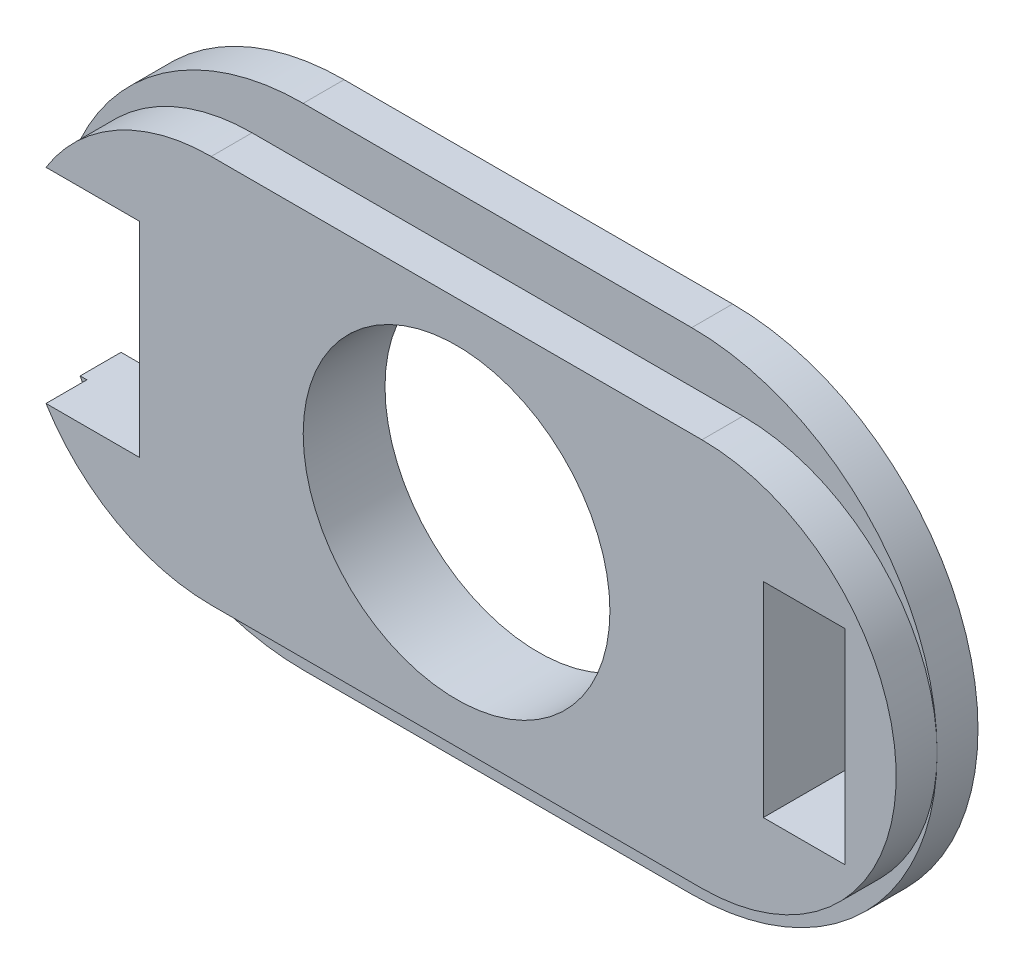
ISO-10303-21;
HEADER;
FILE_DESCRIPTION(('STEP AP214'),'2;1');
FILE_NAME('part.step','',(''),(''),'','','');
FILE_SCHEMA(('AUTOMOTIVE_DESIGN { 1 0 10303 214 1 1 1 1 }'));
ENDSEC;
DATA;
#1=APPLICATION_CONTEXT('core data for automotive mechanical design processes');
#2=APPLICATION_PROTOCOL_DEFINITION('international standard','automotive_design',2000,#1);
#3=PRODUCT_CONTEXT('',#1,'mechanical');
#4=PRODUCT('Part','Part','',(#3));
#5=PRODUCT_RELATED_PRODUCT_CATEGORY('part','',(#4));
#6=PRODUCT_DEFINITION_FORMATION('','',#4);
#7=PRODUCT_DEFINITION_CONTEXT('part definition',#1,'design');
#8=PRODUCT_DEFINITION('design','',#6,#7);
#9=PRODUCT_DEFINITION_SHAPE('','',#8);
#10=(LENGTH_UNIT() NAMED_UNIT(*) SI_UNIT(.MILLI.,.METRE.));
#11=(NAMED_UNIT(*) PLANE_ANGLE_UNIT() SI_UNIT($,.RADIAN.));
#12=(NAMED_UNIT(*) SI_UNIT($,.STERADIAN.) SOLID_ANGLE_UNIT());
#13=UNCERTAINTY_MEASURE_WITH_UNIT(LENGTH_MEASURE(1.E-05),#10,'distance_accuracy_value','');
#14=(GEOMETRIC_REPRESENTATION_CONTEXT(3) GLOBAL_UNCERTAINTY_ASSIGNED_CONTEXT((#13)) GLOBAL_UNIT_ASSIGNED_CONTEXT((#10,
#11,#12)) REPRESENTATION_CONTEXT('',''));
#15=CARTESIAN_POINT('',(0.,0.,0.));
#16=DIRECTION('',(0.,0.,1.));
#17=DIRECTION('',(1.,0.,0.));
#18=AXIS2_PLACEMENT_3D('',#15,#16,#17);
#19=CARTESIAN_POINT('',(-57.049073,21.907042,2.));
#20=DIRECTION('',(0.,0.,-1.));
#21=DIRECTION('',(-1.,0.,0.));
#22=AXIS2_PLACEMENT_3D('',#19,#20,#21);
#23=CYLINDRICAL_SURFACE('',#22,12.);
#24=CARTESIAN_POINT('',(-57.049073,21.907042,0.));
#25=DIRECTION('',(0.,0.,1.));
#26=DIRECTION('',(1.,0.,0.));
#27=AXIS2_PLACEMENT_3D('',#24,#25,#26);
#28=CIRCLE('',#27,12.);
#29=CARTESIAN_POINT('',(-57.049073,33.907042,0.));
#30=VERTEX_POINT('',#29);
#31=CARTESIAN_POINT('',(-67.9577851146357,26.907042,0.));
#32=VERTEX_POINT('',#31);
#33=EDGE_CURVE('E273',#30,#32,#28,.T.);
#34=ORIENTED_EDGE('',*,*,#33,.T.);
#35=DIRECTION('',(0.,0.,-1.));
#36=VECTOR('',#35,1.);
#37=CARTESIAN_POINT('',(-67.9577851146357,26.907042,2.));
#38=LINE('',#37,#36);
#39=CARTESIAN_POINT('',(-67.9577851146357,26.907042,2.));
#40=VERTEX_POINT('',#39);
#41=EDGE_CURVE('E199',#32,#40,#38,.F.);
#42=ORIENTED_EDGE('',*,*,#41,.T.);
#43=CARTESIAN_POINT('',(-57.049073,21.907042,2.));
#44=DIRECTION('',(0.,0.,1.));
#45=DIRECTION('',(1.,0.,0.));
#46=AXIS2_PLACEMENT_3D('',#43,#44,#45);
#47=CIRCLE('',#46,12.);
#48=CARTESIAN_POINT('',(-57.049073,33.907042,2.));
#49=VERTEX_POINT('',#48);
#50=EDGE_CURVE('E283',#49,#40,#47,.T.);
#51=ORIENTED_EDGE('',*,*,#50,.F.);
#52=DIRECTION('',(0.,0.,-1.));
#53=VECTOR('',#52,1.);
#54=CARTESIAN_POINT('',(-57.049073,33.907042,2.));
#55=LINE('',#54,#53);
#56=EDGE_CURVE('E294',#49,#30,#55,.T.);
#57=ORIENTED_EDGE('',*,*,#56,.T.);
#58=EDGE_LOOP('',(#34,#42,#51,#57));
#59=FACE_BOUND('',#58,.T.);
#60=ADVANCED_FACE('F33',(#59),#23,.T.);
#61=CARTESIAN_POINT('',(-59.549073,21.907042,4.));
#62=DIRECTION('',(0.,0.,-1.));
#63=DIRECTION('',(-1.,0.,0.));
#64=AXIS2_PLACEMENT_3D('',#61,#62,#63);
#65=CYLINDRICAL_SURFACE('',#64,9.5);
#66=CARTESIAN_POINT('',(-59.549073,21.907042,2.));
#67=DIRECTION('',(0.,0.,1.));
#68=DIRECTION('',(1.,0.,0.));
#69=AXIS2_PLACEMENT_3D('',#66,#67,#68);
#70=CIRCLE('',#69,9.5);
#71=CARTESIAN_POINT('',(-59.549073,31.407042,2.));
#72=VERTEX_POINT('',#71);
#73=CARTESIAN_POINT('',(-67.6268202107018,26.907042,2.));
#74=VERTEX_POINT('',#73);
#75=EDGE_CURVE('E238',#72,#74,#70,.T.);
#76=ORIENTED_EDGE('',*,*,#75,.T.);
#77=DIRECTION('',(0.,0.,-1.));
#78=VECTOR('',#77,1.);
#79=CARTESIAN_POINT('',(-67.6268202107018,26.907042,4.));
#80=LINE('',#79,#78);
#81=CARTESIAN_POINT('',(-67.6268202107018,26.907042,4.));
#82=VERTEX_POINT('',#81);
#83=EDGE_CURVE('E194',#74,#82,#80,.F.);
#84=ORIENTED_EDGE('',*,*,#83,.T.);
#85=CARTESIAN_POINT('',(-59.549073,21.907042,4.));
#86=DIRECTION('',(0.,0.,1.));
#87=DIRECTION('',(1.,0.,0.));
#88=AXIS2_PLACEMENT_3D('',#85,#86,#87);
#89=CIRCLE('',#88,9.5);
#90=CARTESIAN_POINT('',(-59.549073,31.407042,4.));
#91=VERTEX_POINT('',#90);
#92=EDGE_CURVE('E252',#91,#82,#89,.T.);
#93=ORIENTED_EDGE('',*,*,#92,.F.);
#94=DIRECTION('',(0.,0.,-1.));
#95=VECTOR('',#94,1.);
#96=CARTESIAN_POINT('',(-59.549073,31.407042,4.));
#97=LINE('',#96,#95);
#98=EDGE_CURVE('E260',#91,#72,#97,.T.);
#99=ORIENTED_EDGE('',*,*,#98,.T.);
#100=EDGE_LOOP('',(#76,#84,#93,#99));
#101=FACE_BOUND('',#100,.T.);
#102=ADVANCED_FACE('F363',(#101),#65,.T.);
#103=CARTESIAN_POINT('',(-57.049073,21.907042,2.));
#104=DIRECTION('',(0.,0.,1.));
#105=DIRECTION('',(1.,0.,0.));
#106=AXIS2_PLACEMENT_3D('',#103,#104,#105);
#107=PLANE('',#106);
#108=DIRECTION('',(-1.,0.,0.));
#109=VECTOR('',#108,1.);
#110=CARTESIAN_POINT('',(-57.049073,26.907042,2.));
#111=LINE('',#110,#109);
#112=EDGE_CURVE('E197',#74,#40,#111,.T.);
#113=ORIENTED_EDGE('',*,*,#112,.F.);
#114=ORIENTED_EDGE('',*,*,#75,.F.);
#115=DIRECTION('',(-1.,0.,0.));
#116=VECTOR('',#115,1.);
#117=CARTESIAN_POINT('',(-59.549073,31.407042,2.));
#118=LINE('',#117,#116);
#119=CARTESIAN_POINT('',(-35.549073,31.407042,2.));
#120=VERTEX_POINT('',#119);
#121=EDGE_CURVE('E248',#120,#72,#118,.T.);
#122=ORIENTED_EDGE('',*,*,#121,.F.);
#123=CARTESIAN_POINT('',(-35.549073,21.907042,2.));
#124=DIRECTION('',(0.,0.,1.));
#125=DIRECTION('',(1.,0.,0.));
#126=AXIS2_PLACEMENT_3D('',#123,#124,#125);
#127=CIRCLE('',#126,9.5);
#128=CARTESIAN_POINT('',(-26.049073,21.9070420000001,2.));
#129=VERTEX_POINT('',#128);
#130=EDGE_CURVE('E41',#129,#120,#127,.T.);
#131=ORIENTED_EDGE('',*,*,#130,.F.);
#132=CARTESIAN_POINT('',(-38.049073,21.907042,2.));
#133=DIRECTION('',(0.,0.,1.));
#134=DIRECTION('',(1.,0.,0.));
#135=AXIS2_PLACEMENT_3D('',#132,#133,#134);
#136=CIRCLE('',#135,12.);
#137=CARTESIAN_POINT('',(-38.049073,33.907042,2.));
#138=VERTEX_POINT('',#137);
#139=EDGE_CURVE('E288',#129,#138,#136,.T.);
#140=ORIENTED_EDGE('',*,*,#139,.T.);
#141=DIRECTION('',(-1.,0.,0.));
#142=VECTOR('',#141,1.);
#143=CARTESIAN_POINT('',(-57.049073,33.907042,2.));
#144=LINE('',#143,#142);
#145=EDGE_CURVE('E292',#138,#49,#144,.T.);
#146=ORIENTED_EDGE('',*,*,#145,.T.);
#147=ORIENTED_EDGE('',*,*,#50,.T.);
#148=EDGE_LOOP('',(#113,#114,#122,#131,#140,#146,#147));
#149=FACE_BOUND('',#148,.T.);
#150=ADVANCED_FACE('F338',(#149),#107,.T.);
#151=CARTESIAN_POINT('',(-67.9577851146357,16.907042,2.));
#152=VERTEX_POINT('',#151);
#153=CARTESIAN_POINT('',(-57.049073,9.90704200000002,2.));
#154=VERTEX_POINT('',#153);
#155=EDGE_CURVE('E282',#152,#154,#47,.T.);
#156=ORIENTED_EDGE('',*,*,#155,.F.);
#157=DIRECTION('',(0.,0.,-1.));
#158=VECTOR('',#157,1.);
#159=CARTESIAN_POINT('',(-67.9577851146357,16.907042,2.));
#160=LINE('',#159,#158);
#161=CARTESIAN_POINT('',(-67.9577851146357,16.907042,0.));
#162=VERTEX_POINT('',#161);
#163=EDGE_CURVE('E191',#152,#162,#160,.T.);
#164=ORIENTED_EDGE('',*,*,#163,.T.);
#165=CARTESIAN_POINT('',(-57.049073,9.90704200000002,0.));
#166=VERTEX_POINT('',#165);
#167=EDGE_CURVE('E272',#162,#166,#28,.T.);
#168=ORIENTED_EDGE('',*,*,#167,.T.);
#169=DIRECTION('',(0.,0.,-1.));
#170=VECTOR('',#169,1.);
#171=CARTESIAN_POINT('',(-57.049073,9.90704200000002,2.));
#172=LINE('',#171,#170);
#173=EDGE_CURVE('E302',#154,#166,#172,.T.);
#174=ORIENTED_EDGE('',*,*,#173,.F.);
#175=EDGE_LOOP('',(#156,#164,#168,#174));
#176=FACE_BOUND('',#175,.T.);
#177=ADVANCED_FACE('F35',(#176),#23,.T.);
#178=CARTESIAN_POINT('',(-38.049073,9.90704200000002,2.));
#179=DIRECTION('',(0.,1.,0.));
#180=DIRECTION('',(-1.,0.,0.));
#181=AXIS2_PLACEMENT_3D('',#178,#179,#180);
#182=PLANE('',#181);
#183=DIRECTION('',(1.,0.,0.));
#184=VECTOR('',#183,1.);
#185=CARTESIAN_POINT('',(-38.049073,9.90704200000002,0.));
#186=LINE('',#185,#184);
#187=CARTESIAN_POINT('',(-38.049073,9.90704200000002,0.));
#188=VERTEX_POINT('',#187);
#189=EDGE_CURVE('E276',#166,#188,#186,.T.);
#190=ORIENTED_EDGE('',*,*,#189,.T.);
#191=DIRECTION('',(0.,0.,-1.));
#192=VECTOR('',#191,1.);
#193=CARTESIAN_POINT('',(-38.049073,9.90704200000002,2.));
#194=LINE('',#193,#192);
#195=CARTESIAN_POINT('',(-38.049073,9.90704200000002,2.));
#196=VERTEX_POINT('',#195);
#197=EDGE_CURVE('E300',#196,#188,#194,.T.);
#198=ORIENTED_EDGE('',*,*,#197,.F.);
#199=DIRECTION('',(1.,0.,0.));
#200=VECTOR('',#199,1.);
#201=CARTESIAN_POINT('',(-38.049073,9.90704200000002,2.));
#202=LINE('',#201,#200);
#203=EDGE_CURVE('E286',#154,#196,#202,.T.);
#204=ORIENTED_EDGE('',*,*,#203,.F.);
#205=ORIENTED_EDGE('',*,*,#173,.T.);
#206=EDGE_LOOP('',(#190,#198,#204,#205));
#207=FACE_BOUND('',#206,.T.);
#208=ADVANCED_FACE('F355',(#207),#182,.F.);
#209=CARTESIAN_POINT('',(-38.049073,21.907042,2.));
#210=DIRECTION('',(0.,0.,-1.));
#211=DIRECTION('',(-1.,0.,0.));
#212=AXIS2_PLACEMENT_3D('',#209,#210,#211);
#213=CYLINDRICAL_SURFACE('',#212,12.);
#214=CARTESIAN_POINT('',(-38.049073,21.907042,0.));
#215=DIRECTION('',(0.,0.,1.));
#216=DIRECTION('',(1.,0.,0.));
#217=AXIS2_PLACEMENT_3D('',#214,#215,#216);
#218=CIRCLE('',#217,12.);
#219=CARTESIAN_POINT('',(-38.049073,33.907042,0.));
#220=VERTEX_POINT('',#219);
#221=EDGE_CURVE('E278',#188,#220,#218,.T.);
#222=ORIENTED_EDGE('',*,*,#221,.T.);
#223=DIRECTION('',(0.,0.,-1.));
#224=VECTOR('',#223,1.);
#225=CARTESIAN_POINT('',(-38.049073,33.907042,2.));
#226=LINE('',#225,#224);
#227=EDGE_CURVE('E297',#138,#220,#226,.T.);
#228=ORIENTED_EDGE('',*,*,#227,.F.);
#229=ORIENTED_EDGE('',*,*,#139,.F.);
#230=EDGE_CURVE('E289',#196,#129,#136,.T.);
#231=ORIENTED_EDGE('',*,*,#230,.F.);
#232=ORIENTED_EDGE('',*,*,#197,.T.);
#233=EDGE_LOOP('',(#222,#228,#229,#231,#232));
#234=FACE_BOUND('',#233,.T.);
#235=ADVANCED_FACE('F333',(#234),#213,.T.);
#236=CARTESIAN_POINT('',(-57.049073,33.907042,2.));
#237=DIRECTION('',(0.,-1.,0.));
#238=DIRECTION('',(1.,0.,0.));
#239=AXIS2_PLACEMENT_3D('',#236,#237,#238);
#240=PLANE('',#239);
#241=DIRECTION('',(-1.,0.,0.));
#242=VECTOR('',#241,1.);
#243=CARTESIAN_POINT('',(-57.049073,33.907042,0.));
#244=LINE('',#243,#242);
#245=EDGE_CURVE('E280',#220,#30,#244,.T.);
#246=ORIENTED_EDGE('',*,*,#245,.T.);
#247=ORIENTED_EDGE('',*,*,#56,.F.);
#248=ORIENTED_EDGE('',*,*,#145,.F.);
#249=ORIENTED_EDGE('',*,*,#227,.T.);
#250=EDGE_LOOP('',(#246,#247,#248,#249));
#251=FACE_BOUND('',#250,.T.);
#252=ADVANCED_FACE('F342',(#251),#240,.F.);
#253=DIRECTION('',(1.,0.,0.));
#254=VECTOR('',#253,1.);
#255=CARTESIAN_POINT('',(-57.049073,16.907042,2.));
#256=LINE('',#255,#254);
#257=CARTESIAN_POINT('',(-67.6268202107018,16.907042,2.));
#258=VERTEX_POINT('',#257);
#259=EDGE_CURVE('E189',#152,#258,#256,.T.);
#260=ORIENTED_EDGE('',*,*,#259,.F.);
#261=ORIENTED_EDGE('',*,*,#155,.T.);
#262=ORIENTED_EDGE('',*,*,#203,.T.);
#263=ORIENTED_EDGE('',*,*,#230,.T.);
#264=CARTESIAN_POINT('',(-35.549073,12.407042,2.));
#265=VERTEX_POINT('',#264);
#266=EDGE_CURVE('E245',#265,#129,#127,.T.);
#267=ORIENTED_EDGE('',*,*,#266,.F.);
#268=DIRECTION('',(1.,0.,0.));
#269=VECTOR('',#268,1.);
#270=CARTESIAN_POINT('',(-35.549073,12.407042,2.));
#271=LINE('',#270,#269);
#272=CARTESIAN_POINT('',(-59.549073,12.407042,2.));
#273=VERTEX_POINT('',#272);
#274=EDGE_CURVE('E241',#273,#265,#271,.T.);
#275=ORIENTED_EDGE('',*,*,#274,.F.);
#276=EDGE_CURVE('E242',#258,#273,#70,.T.);
#277=ORIENTED_EDGE('',*,*,#276,.F.);
#278=EDGE_LOOP('',(#260,#261,#262,#263,#267,#275,#277));
#279=FACE_BOUND('',#278,.T.);
#280=ADVANCED_FACE('F329',(#279),#107,.T.);
#281=CARTESIAN_POINT('',(-57.049073,21.907042,0.));
#282=DIRECTION('',(0.,0.,1.));
#283=DIRECTION('',(1.,0.,0.));
#284=AXIS2_PLACEMENT_3D('',#281,#282,#283);
#285=PLANE('',#284);
#286=DIRECTION('',(-1.,0.,0.));
#287=VECTOR('',#286,1.);
#288=CARTESIAN_POINT('',(-32.549073,26.907042,0.));
#289=LINE('',#288,#287);
#290=CARTESIAN_POINT('',(-28.549073,26.907042,0.));
#291=VERTEX_POINT('',#290);
#292=CARTESIAN_POINT('',(-32.549073,26.907042,0.));
#293=VERTEX_POINT('',#292);
#294=EDGE_CURVE('E220',#291,#293,#289,.T.);
#295=ORIENTED_EDGE('',*,*,#294,.T.);
#296=DIRECTION('',(0.,-1.,0.));
#297=VECTOR('',#296,1.);
#298=CARTESIAN_POINT('',(-32.549073,16.907042,0.));
#299=LINE('',#298,#297);
#300=CARTESIAN_POINT('',(-32.549073,16.907042,0.));
#301=VERTEX_POINT('',#300);
#302=EDGE_CURVE('E213',#293,#301,#299,.T.);
#303=ORIENTED_EDGE('',*,*,#302,.T.);
#304=DIRECTION('',(1.,0.,0.));
#305=VECTOR('',#304,1.);
#306=CARTESIAN_POINT('',(-28.549073,16.907042,0.));
#307=LINE('',#306,#305);
#308=CARTESIAN_POINT('',(-28.549073,16.907042,0.));
#309=VERTEX_POINT('',#308);
#310=EDGE_CURVE('E216',#301,#309,#307,.T.);
#311=ORIENTED_EDGE('',*,*,#310,.T.);
#312=DIRECTION('',(0.,1.,0.));
#313=VECTOR('',#312,1.);
#314=CARTESIAN_POINT('',(-28.549073,26.907042,0.));
#315=LINE('',#314,#313);
#316=EDGE_CURVE('E55',#309,#291,#315,.T.);
#317=ORIENTED_EDGE('',*,*,#316,.T.);
#318=EDGE_LOOP('',(#295,#303,#311,#317));
#319=FACE_BOUND('',#318,.T.);
#320=CARTESIAN_POINT('',(-47.549073,21.907042,0.));
#321=DIRECTION('',(0.,0.,1.));
#322=DIRECTION('',(1.,0.,0.));
#323=AXIS2_PLACEMENT_3D('',#320,#321,#322);
#324=CIRCLE('',#323,7.5);
#325=CARTESIAN_POINT('',(-40.049073,21.907042,0.));
#326=VERTEX_POINT('',#325);
#327=EDGE_CURVE('E235',#326,#326,#324,.T.);
#328=ORIENTED_EDGE('',*,*,#327,.T.);
#329=EDGE_LOOP('',(#328));
#330=FACE_BOUND('',#329,.T.);
#331=DIRECTION('',(0.,1.,0.));
#332=VECTOR('',#331,1.);
#333=CARTESIAN_POINT('',(-63.049073,26.907042,0.));
#334=LINE('',#333,#332);
#335=CARTESIAN_POINT('',(-63.049073,16.907042,0.));
#336=VERTEX_POINT('',#335);
#337=CARTESIAN_POINT('',(-63.049073,26.907042,0.));
#338=VERTEX_POINT('',#337);
#339=EDGE_CURVE('E170',#336,#338,#334,.T.);
#340=ORIENTED_EDGE('',*,*,#339,.T.);
#341=DIRECTION('',(-1.,0.,0.));
#342=VECTOR('',#341,1.);
#343=CARTESIAN_POINT('',(-69.049073,26.907042,0.));
#344=LINE('',#343,#342);
#345=EDGE_CURVE('E173',#338,#32,#344,.T.);
#346=ORIENTED_EDGE('',*,*,#345,.T.);
#347=ORIENTED_EDGE('',*,*,#33,.F.);
#348=ORIENTED_EDGE('',*,*,#245,.F.);
#349=ORIENTED_EDGE('',*,*,#221,.F.);
#350=ORIENTED_EDGE('',*,*,#189,.F.);
#351=ORIENTED_EDGE('',*,*,#167,.F.);
#352=DIRECTION('',(1.,0.,0.));
#353=VECTOR('',#352,1.);
#354=CARTESIAN_POINT('',(-63.049073,16.907042,0.));
#355=LINE('',#354,#353);
#356=EDGE_CURVE('E180',#162,#336,#355,.T.);
#357=ORIENTED_EDGE('',*,*,#356,.T.);
#358=EDGE_LOOP('',(#340,#346,#347,#348,#349,#350,#351,#357));
#359=FACE_BOUND('',#358,.T.);
#360=ADVANCED_FACE('F350',(#319,#330,#359),#285,.F.);
#361=CARTESIAN_POINT('',(-67.6268202107018,16.907042,4.));
#362=VERTEX_POINT('',#361);
#363=CARTESIAN_POINT('',(-59.549073,12.407042,4.));
#364=VERTEX_POINT('',#363);
#365=EDGE_CURVE('E251',#362,#364,#89,.T.);
#366=ORIENTED_EDGE('',*,*,#365,.F.);
#367=DIRECTION('',(0.,0.,-1.));
#368=VECTOR('',#367,1.);
#369=CARTESIAN_POINT('',(-67.6268202107018,16.907042,4.));
#370=LINE('',#369,#368);
#371=EDGE_CURVE('E47',#362,#258,#370,.T.);
#372=ORIENTED_EDGE('',*,*,#371,.T.);
#373=ORIENTED_EDGE('',*,*,#276,.T.);
#374=DIRECTION('',(0.,0.,-1.));
#375=VECTOR('',#374,1.);
#376=CARTESIAN_POINT('',(-59.549073,12.407042,4.));
#377=LINE('',#376,#375);
#378=EDGE_CURVE('E269',#364,#273,#377,.T.);
#379=ORIENTED_EDGE('',*,*,#378,.F.);
#380=EDGE_LOOP('',(#366,#372,#373,#379));
#381=FACE_BOUND('',#380,.T.);
#382=ADVANCED_FACE('F369',(#381),#65,.T.);
#383=CARTESIAN_POINT('',(-35.549073,12.407042,4.));
#384=DIRECTION('',(0.,1.,0.));
#385=DIRECTION('',(-1.,0.,0.));
#386=AXIS2_PLACEMENT_3D('',#383,#384,#385);
#387=PLANE('',#386);
#388=ORIENTED_EDGE('',*,*,#274,.T.);
#389=DIRECTION('',(0.,0.,-1.));
#390=VECTOR('',#389,1.);
#391=CARTESIAN_POINT('',(-35.549073,12.407042,4.));
#392=LINE('',#391,#390);
#393=CARTESIAN_POINT('',(-35.549073,12.407042,4.));
#394=VERTEX_POINT('',#393);
#395=EDGE_CURVE('E266',#394,#265,#392,.T.);
#396=ORIENTED_EDGE('',*,*,#395,.F.);
#397=DIRECTION('',(1.,0.,0.));
#398=VECTOR('',#397,1.);
#399=CARTESIAN_POINT('',(-35.549073,12.407042,4.));
#400=LINE('',#399,#398);
#401=EDGE_CURVE('E254',#364,#394,#400,.T.);
#402=ORIENTED_EDGE('',*,*,#401,.F.);
#403=ORIENTED_EDGE('',*,*,#378,.T.);
#404=EDGE_LOOP('',(#388,#396,#402,#403));
#405=FACE_BOUND('',#404,.T.);
#406=ADVANCED_FACE('F326',(#405),#387,.F.);
#407=CARTESIAN_POINT('',(-35.549073,21.907042,4.));
#408=DIRECTION('',(0.,0.,-1.));
#409=DIRECTION('',(-1.,0.,0.));
#410=AXIS2_PLACEMENT_3D('',#407,#408,#409);
#411=CYLINDRICAL_SURFACE('',#410,9.5);
#412=ORIENTED_EDGE('',*,*,#266,.T.);
#413=ORIENTED_EDGE('',*,*,#130,.T.);
#414=DIRECTION('',(0.,0.,-1.));
#415=VECTOR('',#414,1.);
#416=CARTESIAN_POINT('',(-35.549073,31.407042,4.));
#417=LINE('',#416,#415);
#418=CARTESIAN_POINT('',(-35.549073,31.407042,4.));
#419=VERTEX_POINT('',#418);
#420=EDGE_CURVE('E263',#419,#120,#417,.T.);
#421=ORIENTED_EDGE('',*,*,#420,.F.);
#422=CARTESIAN_POINT('',(-35.549073,21.907042,4.));
#423=DIRECTION('',(0.,0.,1.));
#424=DIRECTION('',(1.,0.,0.));
#425=AXIS2_PLACEMENT_3D('',#422,#423,#424);
#426=CIRCLE('',#425,9.5);
#427=EDGE_CURVE('E256',#394,#419,#426,.T.);
#428=ORIENTED_EDGE('',*,*,#427,.F.);
#429=ORIENTED_EDGE('',*,*,#395,.T.);
#430=EDGE_LOOP('',(#412,#413,#421,#428,#429));
#431=FACE_BOUND('',#430,.T.);
#432=ADVANCED_FACE('F314',(#431),#411,.T.);
#433=CARTESIAN_POINT('',(-59.549073,31.407042,4.));
#434=DIRECTION('',(0.,-1.,0.));
#435=DIRECTION('',(1.,0.,0.));
#436=AXIS2_PLACEMENT_3D('',#433,#434,#435);
#437=PLANE('',#436);
#438=ORIENTED_EDGE('',*,*,#121,.T.);
#439=ORIENTED_EDGE('',*,*,#98,.F.);
#440=DIRECTION('',(-1.,0.,0.));
#441=VECTOR('',#440,1.);
#442=CARTESIAN_POINT('',(-59.549073,31.407042,4.));
#443=LINE('',#442,#441);
#444=EDGE_CURVE('E258',#419,#91,#443,.T.);
#445=ORIENTED_EDGE('',*,*,#444,.F.);
#446=ORIENTED_EDGE('',*,*,#420,.T.);
#447=EDGE_LOOP('',(#438,#439,#445,#446));
#448=FACE_BOUND('',#447,.T.);
#449=ADVANCED_FACE('F320',(#448),#437,.F.);
#450=CARTESIAN_POINT('',(-59.549073,21.907042,4.));
#451=DIRECTION('',(0.,0.,1.));
#452=DIRECTION('',(1.,0.,0.));
#453=AXIS2_PLACEMENT_3D('',#450,#451,#452);
#454=PLANE('',#453);
#455=DIRECTION('',(-1.,0.,0.));
#456=VECTOR('',#455,1.);
#457=CARTESIAN_POINT('',(-69.049073,26.907042,4.));
#458=LINE('',#457,#456);
#459=CARTESIAN_POINT('',(-63.049073,26.907042,4.));
#460=VERTEX_POINT('',#459);
#461=EDGE_CURVE('E178',#460,#82,#458,.T.);
#462=ORIENTED_EDGE('',*,*,#461,.F.);
#463=DIRECTION('',(0.,1.,0.));
#464=VECTOR('',#463,1.);
#465=CARTESIAN_POINT('',(-63.049073,26.907042,4.));
#466=LINE('',#465,#464);
#467=CARTESIAN_POINT('',(-63.049073,16.907042,4.));
#468=VERTEX_POINT('',#467);
#469=EDGE_CURVE('E167',#468,#460,#466,.T.);
#470=ORIENTED_EDGE('',*,*,#469,.F.);
#471=DIRECTION('',(1.,0.,0.));
#472=VECTOR('',#471,1.);
#473=CARTESIAN_POINT('',(-59.549073,16.907042,4.));
#474=LINE('',#473,#472);
#475=EDGE_CURVE('E11',#362,#468,#474,.T.);
#476=ORIENTED_EDGE('',*,*,#475,.F.);
#477=ORIENTED_EDGE('',*,*,#365,.T.);
#478=ORIENTED_EDGE('',*,*,#401,.T.);
#479=ORIENTED_EDGE('',*,*,#427,.T.);
#480=ORIENTED_EDGE('',*,*,#444,.T.);
#481=ORIENTED_EDGE('',*,*,#92,.T.);
#482=EDGE_LOOP('',(#462,#470,#476,#477,#478,#479,#480,#481));
#483=FACE_BOUND('',#482,.T.);
#484=DIRECTION('',(0.,-1.,0.));
#485=VECTOR('',#484,1.);
#486=CARTESIAN_POINT('',(-32.549073,16.907042,4.));
#487=LINE('',#486,#485);
#488=CARTESIAN_POINT('',(-32.549073,26.907042,4.));
#489=VERTEX_POINT('',#488);
#490=CARTESIAN_POINT('',(-32.549073,16.907042,4.));
#491=VERTEX_POINT('',#490);
#492=EDGE_CURVE('E202',#489,#491,#487,.T.);
#493=ORIENTED_EDGE('',*,*,#492,.F.);
#494=DIRECTION('',(-1.,0.,0.));
#495=VECTOR('',#494,1.);
#496=CARTESIAN_POINT('',(-32.549073,26.907042,4.));
#497=LINE('',#496,#495);
#498=CARTESIAN_POINT('',(-28.549073,26.907042,4.));
#499=VERTEX_POINT('',#498);
#500=EDGE_CURVE('E210',#499,#489,#497,.T.);
#501=ORIENTED_EDGE('',*,*,#500,.F.);
#502=DIRECTION('',(0.,1.,0.));
#503=VECTOR('',#502,1.);
#504=CARTESIAN_POINT('',(-28.549073,26.907042,4.));
#505=LINE('',#504,#503);
#506=CARTESIAN_POINT('',(-28.549073,16.907042,4.));
#507=VERTEX_POINT('',#506);
#508=EDGE_CURVE('E207',#507,#499,#505,.T.);
#509=ORIENTED_EDGE('',*,*,#508,.F.);
#510=DIRECTION('',(1.,0.,0.));
#511=VECTOR('',#510,1.);
#512=CARTESIAN_POINT('',(-28.549073,16.907042,4.));
#513=LINE('',#512,#511);
#514=EDGE_CURVE('E204',#491,#507,#513,.T.);
#515=ORIENTED_EDGE('',*,*,#514,.F.);
#516=EDGE_LOOP('',(#493,#501,#509,#515));
#517=FACE_BOUND('',#516,.T.);
#518=CARTESIAN_POINT('',(-47.549073,21.907042,4.));
#519=DIRECTION('',(0.,0.,1.));
#520=DIRECTION('',(1.,0.,0.));
#521=AXIS2_PLACEMENT_3D('',#518,#519,#520);
#522=CIRCLE('',#521,7.5);
#523=CARTESIAN_POINT('',(-40.049073,21.907042,4.));
#524=VERTEX_POINT('',#523);
#525=EDGE_CURVE('E226',#524,#524,#522,.T.);
#526=ORIENTED_EDGE('',*,*,#525,.F.);
#527=EDGE_LOOP('',(#526));
#528=FACE_BOUND('',#527,.T.);
#529=ADVANCED_FACE('F175',(#483,#517,#528),#454,.T.);
#530=CARTESIAN_POINT('',(-47.549073,21.907042,0.));
#531=DIRECTION('',(0.,0.,1.));
#532=DIRECTION('',(1.,0.,0.));
#533=AXIS2_PLACEMENT_3D('',#530,#531,#532);
#534=CYLINDRICAL_SURFACE('',#533,7.5);
#535=ORIENTED_EDGE('',*,*,#327,.F.);
#536=EDGE_LOOP('',(#535));
#537=FACE_BOUND('',#536,.T.);
#538=ORIENTED_EDGE('',*,*,#525,.T.);
#539=EDGE_LOOP('',(#538));
#540=FACE_BOUND('',#539,.T.);
#541=ADVANCED_FACE('F419',(#537,#540),#534,.F.);
#542=CARTESIAN_POINT('',(-32.549073,16.907042,0.));
#543=DIRECTION('',(-1.,0.,0.));
#544=DIRECTION('',(0.,-1.,0.));
#545=AXIS2_PLACEMENT_3D('',#542,#543,#544);
#546=PLANE('',#545);
#547=ORIENTED_EDGE('',*,*,#492,.T.);
#548=DIRECTION('',(0.,0.,1.));
#549=VECTOR('',#548,1.);
#550=CARTESIAN_POINT('',(-32.549073,16.907042,0.));
#551=LINE('',#550,#549);
#552=EDGE_CURVE('E223',#301,#491,#551,.T.);
#553=ORIENTED_EDGE('',*,*,#552,.F.);
#554=ORIENTED_EDGE('',*,*,#302,.F.);
#555=DIRECTION('',(0.,0.,1.));
#556=VECTOR('',#555,1.);
#557=CARTESIAN_POINT('',(-32.549073,26.907042,0.));
#558=LINE('',#557,#556);
#559=EDGE_CURVE('E224',#293,#489,#558,.T.);
#560=ORIENTED_EDGE('',*,*,#559,.T.);
#561=EDGE_LOOP('',(#547,#553,#554,#560));
#562=FACE_BOUND('',#561,.T.);
#563=ADVANCED_FACE('F431',(#562),#546,.F.);
#564=CARTESIAN_POINT('',(-32.549073,26.907042,0.));
#565=DIRECTION('',(0.,1.,0.));
#566=DIRECTION('',(0.,0.,1.));
#567=AXIS2_PLACEMENT_3D('',#564,#565,#566);
#568=PLANE('',#567);
#569=ORIENTED_EDGE('',*,*,#500,.T.);
#570=ORIENTED_EDGE('',*,*,#559,.F.);
#571=ORIENTED_EDGE('',*,*,#294,.F.);
#572=DIRECTION('',(0.,0.,1.));
#573=VECTOR('',#572,1.);
#574=CARTESIAN_POINT('',(-28.549073,26.907042,0.));
#575=LINE('',#574,#573);
#576=EDGE_CURVE('E227',#291,#499,#575,.T.);
#577=ORIENTED_EDGE('',*,*,#576,.T.);
#578=EDGE_LOOP('',(#569,#570,#571,#577));
#579=FACE_BOUND('',#578,.T.);
#580=ADVANCED_FACE('F442',(#579),#568,.F.);
#581=CARTESIAN_POINT('',(-28.549073,26.907042,0.));
#582=DIRECTION('',(1.,0.,0.));
#583=DIRECTION('',(0.,0.,-1.));
#584=AXIS2_PLACEMENT_3D('',#581,#582,#583);
#585=PLANE('',#584);
#586=ORIENTED_EDGE('',*,*,#508,.T.);
#587=ORIENTED_EDGE('',*,*,#576,.F.);
#588=ORIENTED_EDGE('',*,*,#316,.F.);
#589=DIRECTION('',(0.,0.,1.));
#590=VECTOR('',#589,1.);
#591=CARTESIAN_POINT('',(-28.549073,16.907042,0.));
#592=LINE('',#591,#590);
#593=EDGE_CURVE('E229',#309,#507,#592,.T.);
#594=ORIENTED_EDGE('',*,*,#593,.T.);
#595=EDGE_LOOP('',(#586,#587,#588,#594));
#596=FACE_BOUND('',#595,.T.);
#597=ADVANCED_FACE('F452',(#596),#585,.F.);
#598=CARTESIAN_POINT('',(-28.549073,16.907042,0.));
#599=DIRECTION('',(0.,-1.,0.));
#600=DIRECTION('',(0.,0.,-1.));
#601=AXIS2_PLACEMENT_3D('',#598,#599,#600);
#602=PLANE('',#601);
#603=ORIENTED_EDGE('',*,*,#514,.T.);
#604=ORIENTED_EDGE('',*,*,#593,.F.);
#605=ORIENTED_EDGE('',*,*,#310,.F.);
#606=ORIENTED_EDGE('',*,*,#552,.T.);
#607=EDGE_LOOP('',(#603,#604,#605,#606));
#608=FACE_BOUND('',#607,.T.);
#609=ADVANCED_FACE('F462',(#608),#602,.F.);
#610=CARTESIAN_POINT('',(-69.049073,26.907042,0.));
#611=DIRECTION('',(0.,1.,0.));
#612=DIRECTION('',(0.,0.,1.));
#613=AXIS2_PLACEMENT_3D('',#610,#611,#612);
#614=PLANE('',#613);
#615=ORIENTED_EDGE('',*,*,#345,.F.);
#616=DIRECTION('',(0.,0.,1.));
#617=VECTOR('',#616,1.);
#618=CARTESIAN_POINT('',(-63.049073,26.907042,0.));
#619=LINE('',#618,#617);
#620=EDGE_CURVE('E172',#338,#460,#619,.T.);
#621=ORIENTED_EDGE('',*,*,#620,.T.);
#622=ORIENTED_EDGE('',*,*,#461,.T.);
#623=ORIENTED_EDGE('',*,*,#83,.F.);
#624=ORIENTED_EDGE('',*,*,#112,.T.);
#625=ORIENTED_EDGE('',*,*,#41,.F.);
#626=EDGE_LOOP('',(#615,#621,#622,#623,#624,#625));
#627=FACE_BOUND('',#626,.T.);
#628=ADVANCED_FACE('F348',(#627),#614,.F.);
#629=CARTESIAN_POINT('',(-63.049073,16.907042,0.));
#630=DIRECTION('',(0.,-1.,0.));
#631=DIRECTION('',(0.,0.,-1.));
#632=AXIS2_PLACEMENT_3D('',#629,#630,#631);
#633=PLANE('',#632);
#634=ORIENTED_EDGE('',*,*,#259,.T.);
#635=ORIENTED_EDGE('',*,*,#371,.F.);
#636=ORIENTED_EDGE('',*,*,#475,.T.);
#637=DIRECTION('',(0.,0.,1.));
#638=VECTOR('',#637,1.);
#639=CARTESIAN_POINT('',(-63.049073,16.907042,0.));
#640=LINE('',#639,#638);
#641=EDGE_CURVE('E159',#336,#468,#640,.T.);
#642=ORIENTED_EDGE('',*,*,#641,.F.);
#643=ORIENTED_EDGE('',*,*,#356,.F.);
#644=ORIENTED_EDGE('',*,*,#163,.F.);
#645=EDGE_LOOP('',(#634,#635,#636,#642,#643,#644));
#646=FACE_BOUND('',#645,.T.);
#647=ADVANCED_FACE('F158',(#646),#633,.F.);
#648=CARTESIAN_POINT('',(-63.049073,26.907042,0.));
#649=DIRECTION('',(1.,0.,0.));
#650=DIRECTION('',(0.,0.,-1.));
#651=AXIS2_PLACEMENT_3D('',#648,#649,#650);
#652=PLANE('',#651);
#653=ORIENTED_EDGE('',*,*,#469,.T.);
#654=ORIENTED_EDGE('',*,*,#620,.F.);
#655=ORIENTED_EDGE('',*,*,#339,.F.);
#656=ORIENTED_EDGE('',*,*,#641,.T.);
#657=EDGE_LOOP('',(#653,#654,#655,#656));
#658=FACE_BOUND('',#657,.T.);
#659=ADVANCED_FACE('F166',(#658),#652,.F.);
#660=CLOSED_SHELL('',(#60,#102,#150,#177,#208,#235,#252,#280,#360,#382,#406,#432,#449,#529,#541,
#563,#580,#597,#609,#628,#647,#659));
#661=MANIFOLD_SOLID_BREP('B2',#660);
#662=ADVANCED_BREP_SHAPE_REPRESENTATION('',(#18,#661),#14);
#663=SHAPE_DEFINITION_REPRESENTATION(#9,#662);
ENDSEC;
END-ISO-10303-21;
